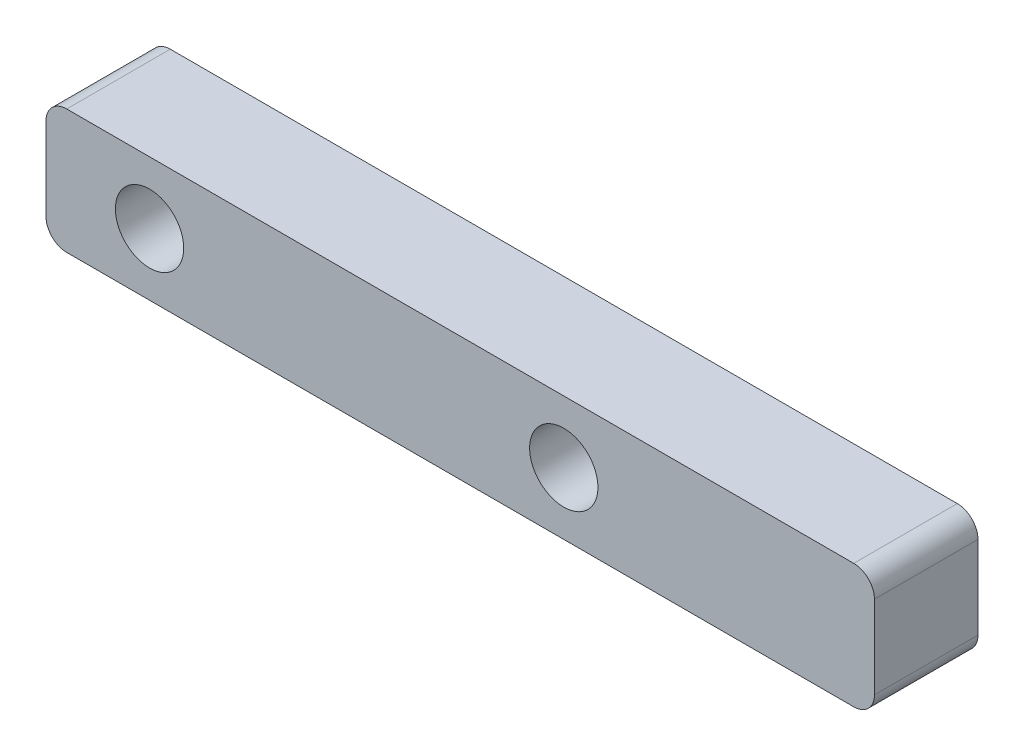
ISO-10303-21;
HEADER;
FILE_DESCRIPTION(('STEP AP214'),'2;1');
FILE_NAME('part.step','',(''),(''),'','','');
FILE_SCHEMA(('AUTOMOTIVE_DESIGN { 1 0 10303 214 1 1 1 1 }'));
ENDSEC;
DATA;
#1=APPLICATION_CONTEXT('core data for automotive mechanical design processes');
#2=APPLICATION_PROTOCOL_DEFINITION('international standard','automotive_design',2000,#1);
#3=PRODUCT_CONTEXT('',#1,'mechanical');
#4=PRODUCT('Part','Part','',(#3));
#5=PRODUCT_RELATED_PRODUCT_CATEGORY('part','',(#4));
#6=PRODUCT_DEFINITION_FORMATION('','',#4);
#7=PRODUCT_DEFINITION_CONTEXT('part definition',#1,'design');
#8=PRODUCT_DEFINITION('design','',#6,#7);
#9=PRODUCT_DEFINITION_SHAPE('','',#8);
#10=(LENGTH_UNIT() NAMED_UNIT(*) SI_UNIT(.MILLI.,.METRE.));
#11=(NAMED_UNIT(*) PLANE_ANGLE_UNIT() SI_UNIT($,.RADIAN.));
#12=(NAMED_UNIT(*) SI_UNIT($,.STERADIAN.) SOLID_ANGLE_UNIT());
#13=UNCERTAINTY_MEASURE_WITH_UNIT(LENGTH_MEASURE(1.E-05),#10,'distance_accuracy_value','');
#14=(GEOMETRIC_REPRESENTATION_CONTEXT(3) GLOBAL_UNCERTAINTY_ASSIGNED_CONTEXT((#13)) GLOBAL_UNIT_ASSIGNED_CONTEXT((#10,
#11,#12)) REPRESENTATION_CONTEXT('',''));
#15=CARTESIAN_POINT('',(0.,0.,0.));
#16=DIRECTION('',(0.,0.,1.));
#17=DIRECTION('',(1.,0.,0.));
#18=AXIS2_PLACEMENT_3D('',#15,#16,#17);
#19=CARTESIAN_POINT('',(20.,-3.,5.));
#20=DIRECTION('',(-1.,0.,0.));
#21=DIRECTION('',(0.,0.,1.));
#22=AXIS2_PLACEMENT_3D('',#19,#20,#21);
#23=PLANE('',#22);
#24=DIRECTION('',(0.,1.,0.));
#25=VECTOR('',#24,1.);
#26=CARTESIAN_POINT('',(20.,-3.,5.));
#27=LINE('',#26,#25);
#28=CARTESIAN_POINT('',(20.,-2.,5.));
#29=VERTEX_POINT('',#28);
#30=CARTESIAN_POINT('',(20.,2.,5.));
#31=VERTEX_POINT('',#30);
#32=EDGE_CURVE('E121',#29,#31,#27,.T.);
#33=ORIENTED_EDGE('',*,*,#32,.F.);
#34=DIRECTION('',(0.,0.,-1.));
#35=VECTOR('',#34,1.);
#36=CARTESIAN_POINT('',(20.,-2.,5.));
#37=LINE('',#36,#35);
#38=CARTESIAN_POINT('',(20.,-2.,0.));
#39=VERTEX_POINT('',#38);
#40=EDGE_CURVE('E106',#29,#39,#37,.T.);
#41=ORIENTED_EDGE('',*,*,#40,.T.);
#42=DIRECTION('',(0.,1.,0.));
#43=VECTOR('',#42,1.);
#44=CARTESIAN_POINT('',(20.,-3.,0.));
#45=LINE('',#44,#43);
#46=CARTESIAN_POINT('',(20.,2.,0.));
#47=VERTEX_POINT('',#46);
#48=EDGE_CURVE('E118',#39,#47,#45,.T.);
#49=ORIENTED_EDGE('',*,*,#48,.T.);
#50=DIRECTION('',(0.,0.,-1.));
#51=VECTOR('',#50,1.);
#52=CARTESIAN_POINT('',(20.,2.,5.));
#53=LINE('',#52,#51);
#54=EDGE_CURVE('E123',#47,#31,#53,.F.);
#55=ORIENTED_EDGE('',*,*,#54,.T.);
#56=EDGE_LOOP('',(#33,#41,#49,#55));
#57=FACE_BOUND('',#56,.T.);
#58=ADVANCED_FACE('F35',(#57),#23,.F.);
#59=CARTESIAN_POINT('',(-20.,3.,5.));
#60=DIRECTION('',(0.,-1.,0.));
#61=DIRECTION('',(0.,0.,-1.));
#62=AXIS2_PLACEMENT_3D('',#59,#60,#61);
#63=PLANE('',#62);
#64=DIRECTION('',(-1.,0.,0.));
#65=VECTOR('',#64,1.);
#66=CARTESIAN_POINT('',(-20.,3.,5.));
#67=LINE('',#66,#65);
#68=CARTESIAN_POINT('',(19.,3.,5.));
#69=VERTEX_POINT('',#68);
#70=CARTESIAN_POINT('',(-19.,3.,5.));
#71=VERTEX_POINT('',#70);
#72=EDGE_CURVE('E168',#69,#71,#67,.T.);
#73=ORIENTED_EDGE('',*,*,#72,.F.);
#74=DIRECTION('',(0.,0.,-1.));
#75=VECTOR('',#74,1.);
#76=CARTESIAN_POINT('',(19.,3.,5.));
#77=LINE('',#76,#75);
#78=CARTESIAN_POINT('',(19.,3.,0.));
#79=VERTEX_POINT('',#78);
#80=EDGE_CURVE('E11',#69,#79,#77,.T.);
#81=ORIENTED_EDGE('',*,*,#80,.T.);
#82=DIRECTION('',(-1.,0.,0.));
#83=VECTOR('',#82,1.);
#84=CARTESIAN_POINT('',(-20.,3.,0.));
#85=LINE('',#84,#83);
#86=CARTESIAN_POINT('',(-19.,3.,0.));
#87=VERTEX_POINT('',#86);
#88=EDGE_CURVE('E128',#79,#87,#85,.T.);
#89=ORIENTED_EDGE('',*,*,#88,.T.);
#90=DIRECTION('',(0.,0.,-1.));
#91=VECTOR('',#90,1.);
#92=CARTESIAN_POINT('',(-19.,3.,5.));
#93=LINE('',#92,#91);
#94=EDGE_CURVE('E43',#87,#71,#93,.F.);
#95=ORIENTED_EDGE('',*,*,#94,.T.);
#96=EDGE_LOOP('',(#73,#81,#89,#95));
#97=FACE_BOUND('',#96,.T.);
#98=ADVANCED_FACE('F167',(#97),#63,.F.);
#99=CARTESIAN_POINT('',(-20.,-3.,5.));
#100=DIRECTION('',(1.,0.,0.));
#101=DIRECTION('',(0.,0.,-1.));
#102=AXIS2_PLACEMENT_3D('',#99,#100,#101);
#103=PLANE('',#102);
#104=DIRECTION('',(0.,-1.,0.));
#105=VECTOR('',#104,1.);
#106=CARTESIAN_POINT('',(-20.,-3.,0.));
#107=LINE('',#106,#105);
#108=CARTESIAN_POINT('',(-20.,2.,0.));
#109=VERTEX_POINT('',#108);
#110=CARTESIAN_POINT('',(-20.,-2.,0.));
#111=VERTEX_POINT('',#110);
#112=EDGE_CURVE('E132',#109,#111,#107,.T.);
#113=ORIENTED_EDGE('',*,*,#112,.T.);
#114=DIRECTION('',(0.,0.,-1.));
#115=VECTOR('',#114,1.);
#116=CARTESIAN_POINT('',(-20.,-2.,5.));
#117=LINE('',#116,#115);
#118=CARTESIAN_POINT('',(-20.,-2.,5.));
#119=VERTEX_POINT('',#118);
#120=EDGE_CURVE('E50',#111,#119,#117,.F.);
#121=ORIENTED_EDGE('',*,*,#120,.T.);
#122=DIRECTION('',(0.,-1.,0.));
#123=VECTOR('',#122,1.);
#124=CARTESIAN_POINT('',(-20.,-3.,5.));
#125=LINE('',#124,#123);
#126=CARTESIAN_POINT('',(-20.,2.,5.));
#127=VERTEX_POINT('',#126);
#128=EDGE_CURVE('E174',#127,#119,#125,.T.);
#129=ORIENTED_EDGE('',*,*,#128,.F.);
#130=DIRECTION('',(0.,0.,-1.));
#131=VECTOR('',#130,1.);
#132=CARTESIAN_POINT('',(-20.,2.,5.));
#133=LINE('',#132,#131);
#134=EDGE_CURVE('E161',#127,#109,#133,.T.);
#135=ORIENTED_EDGE('',*,*,#134,.T.);
#136=EDGE_LOOP('',(#113,#121,#129,#135));
#137=FACE_BOUND('',#136,.T.);
#138=ADVANCED_FACE('F178',(#137),#103,.F.);
#139=CARTESIAN_POINT('',(-20.,-3.,5.));
#140=DIRECTION('',(0.,1.,0.));
#141=DIRECTION('',(0.,0.,1.));
#142=AXIS2_PLACEMENT_3D('',#139,#140,#141);
#143=PLANE('',#142);
#144=DIRECTION('',(1.,0.,0.));
#145=VECTOR('',#144,1.);
#146=CARTESIAN_POINT('',(-20.,-3.,0.));
#147=LINE('',#146,#145);
#148=CARTESIAN_POINT('',(-19.,-3.,0.));
#149=VERTEX_POINT('',#148);
#150=CARTESIAN_POINT('',(19.,-3.,0.));
#151=VERTEX_POINT('',#150);
#152=EDGE_CURVE('E142',#149,#151,#147,.T.);
#153=ORIENTED_EDGE('',*,*,#152,.T.);
#154=DIRECTION('',(0.,0.,-1.));
#155=VECTOR('',#154,1.);
#156=CARTESIAN_POINT('',(19.,-3.,5.));
#157=LINE('',#156,#155);
#158=CARTESIAN_POINT('',(19.,-3.,5.));
#159=VERTEX_POINT('',#158);
#160=EDGE_CURVE('E107',#151,#159,#157,.F.);
#161=ORIENTED_EDGE('',*,*,#160,.T.);
#162=DIRECTION('',(1.,0.,0.));
#163=VECTOR('',#162,1.);
#164=CARTESIAN_POINT('',(-20.,-3.,5.));
#165=LINE('',#164,#163);
#166=CARTESIAN_POINT('',(-19.,-3.,5.));
#167=VERTEX_POINT('',#166);
#168=EDGE_CURVE('E138',#167,#159,#165,.T.);
#169=ORIENTED_EDGE('',*,*,#168,.F.);
#170=DIRECTION('',(0.,0.,-1.));
#171=VECTOR('',#170,1.);
#172=CARTESIAN_POINT('',(-19.,-3.,5.));
#173=LINE('',#172,#171);
#174=EDGE_CURVE('E112',#167,#149,#173,.T.);
#175=ORIENTED_EDGE('',*,*,#174,.T.);
#176=EDGE_LOOP('',(#153,#161,#169,#175));
#177=FACE_BOUND('',#176,.T.);
#178=ADVANCED_FACE('F185',(#177),#143,.F.);
#179=CARTESIAN_POINT('',(0.,0.,5.));
#180=DIRECTION('',(0.,0.,-1.));
#181=DIRECTION('',(-1.,0.,0.));
#182=AXIS2_PLACEMENT_3D('',#179,#180,#181);
#183=PLANE('',#182);
#184=CARTESIAN_POINT('',(5.00000000000001,0.,5.));
#185=DIRECTION('',(0.,0.,1.));
#186=DIRECTION('',(1.,0.,0.));
#187=AXIS2_PLACEMENT_3D('',#184,#185,#186);
#188=CIRCLE('',#187,1.65);
#189=CARTESIAN_POINT('',(6.65000000000001,0.,5.));
#190=VERTEX_POINT('',#189);
#191=EDGE_CURVE('E145',#190,#190,#188,.T.);
#192=ORIENTED_EDGE('',*,*,#191,.F.);
#193=EDGE_LOOP('',(#192));
#194=FACE_BOUND('',#193,.T.);
#195=CARTESIAN_POINT('',(-15.,0.,5.));
#196=DIRECTION('',(0.,0.,1.));
#197=DIRECTION('',(1.,0.,0.));
#198=AXIS2_PLACEMENT_3D('',#195,#196,#197);
#199=CIRCLE('',#198,1.65);
#200=CARTESIAN_POINT('',(-13.35,0.,5.));
#201=VERTEX_POINT('',#200);
#202=EDGE_CURVE('E188',#201,#201,#199,.T.);
#203=ORIENTED_EDGE('',*,*,#202,.F.);
#204=EDGE_LOOP('',(#203));
#205=FACE_BOUND('',#204,.T.);
#206=ORIENTED_EDGE('',*,*,#168,.T.);
#207=CARTESIAN_POINT('',(19.,-2.,5.));
#208=DIRECTION('',(0.,0.,-1.));
#209=DIRECTION('',(-1.,0.,0.));
#210=AXIS2_PLACEMENT_3D('',#207,#208,#209);
#211=CIRCLE('',#210,1.);
#212=EDGE_CURVE('E159',#159,#29,#211,.F.);
#213=ORIENTED_EDGE('',*,*,#212,.T.);
#214=ORIENTED_EDGE('',*,*,#32,.T.);
#215=CARTESIAN_POINT('',(19.,2.,5.));
#216=DIRECTION('',(0.,0.,-1.));
#217=DIRECTION('',(-1.,0.,0.));
#218=AXIS2_PLACEMENT_3D('',#215,#216,#217);
#219=CIRCLE('',#218,1.);
#220=EDGE_CURVE('E155',#31,#69,#219,.F.);
#221=ORIENTED_EDGE('',*,*,#220,.T.);
#222=ORIENTED_EDGE('',*,*,#72,.T.);
#223=CARTESIAN_POINT('',(-19.,2.,5.));
#224=DIRECTION('',(0.,0.,-1.));
#225=DIRECTION('',(-1.,0.,0.));
#226=AXIS2_PLACEMENT_3D('',#223,#224,#225);
#227=CIRCLE('',#226,1.);
#228=EDGE_CURVE('E57',#71,#127,#227,.F.);
#229=ORIENTED_EDGE('',*,*,#228,.T.);
#230=ORIENTED_EDGE('',*,*,#128,.T.);
#231=CARTESIAN_POINT('',(-19.,-2.,5.));
#232=DIRECTION('',(0.,0.,-1.));
#233=DIRECTION('',(-1.,0.,0.));
#234=AXIS2_PLACEMENT_3D('',#231,#232,#233);
#235=CIRCLE('',#234,1.);
#236=EDGE_CURVE('E157',#119,#167,#235,.F.);
#237=ORIENTED_EDGE('',*,*,#236,.T.);
#238=EDGE_LOOP('',(#206,#213,#214,#221,#222,#229,#230,#237));
#239=FACE_BOUND('',#238,.T.);
#240=ADVANCED_FACE('F172',(#194,#205,#239),#183,.F.);
#241=CARTESIAN_POINT('',(0.,0.,0.));
#242=DIRECTION('',(0.,0.,-1.));
#243=DIRECTION('',(-1.,0.,0.));
#244=AXIS2_PLACEMENT_3D('',#241,#242,#243);
#245=PLANE('',#244);
#246=CARTESIAN_POINT('',(5.00000000000001,0.,0.));
#247=DIRECTION('',(0.,0.,-1.));
#248=DIRECTION('',(-1.,0.,0.));
#249=AXIS2_PLACEMENT_3D('',#246,#247,#248);
#250=CIRCLE('',#249,1.65);
#251=CARTESIAN_POINT('',(3.35000000000001,0.,0.));
#252=VERTEX_POINT('',#251);
#253=EDGE_CURVE('E129',#252,#252,#250,.T.);
#254=ORIENTED_EDGE('',*,*,#253,.F.);
#255=EDGE_LOOP('',(#254));
#256=FACE_BOUND('',#255,.T.);
#257=CARTESIAN_POINT('',(-15.,0.,0.));
#258=DIRECTION('',(0.,0.,-1.));
#259=DIRECTION('',(-1.,0.,0.));
#260=AXIS2_PLACEMENT_3D('',#257,#258,#259);
#261=CIRCLE('',#260,1.65);
#262=CARTESIAN_POINT('',(-16.65,0.,0.));
#263=VERTEX_POINT('',#262);
#264=EDGE_CURVE('E135',#263,#263,#261,.T.);
#265=ORIENTED_EDGE('',*,*,#264,.F.);
#266=EDGE_LOOP('',(#265));
#267=FACE_BOUND('',#266,.T.);
#268=ORIENTED_EDGE('',*,*,#48,.F.);
#269=CARTESIAN_POINT('',(19.,-2.,0.));
#270=DIRECTION('',(0.,0.,-1.));
#271=DIRECTION('',(-1.,0.,0.));
#272=AXIS2_PLACEMENT_3D('',#269,#270,#271);
#273=CIRCLE('',#272,1.);
#274=EDGE_CURVE('E102',#39,#151,#273,.T.);
#275=ORIENTED_EDGE('',*,*,#274,.T.);
#276=ORIENTED_EDGE('',*,*,#152,.F.);
#277=CARTESIAN_POINT('',(-19.,-2.,0.));
#278=DIRECTION('',(0.,0.,-1.));
#279=DIRECTION('',(-1.,0.,0.));
#280=AXIS2_PLACEMENT_3D('',#277,#278,#279);
#281=CIRCLE('',#280,1.);
#282=EDGE_CURVE('E113',#149,#111,#281,.T.);
#283=ORIENTED_EDGE('',*,*,#282,.T.);
#284=ORIENTED_EDGE('',*,*,#112,.F.);
#285=CARTESIAN_POINT('',(-19.,2.,0.));
#286=DIRECTION('',(0.,0.,-1.));
#287=DIRECTION('',(-1.,0.,0.));
#288=AXIS2_PLACEMENT_3D('',#285,#286,#287);
#289=CIRCLE('',#288,1.);
#290=EDGE_CURVE('E122',#109,#87,#289,.T.);
#291=ORIENTED_EDGE('',*,*,#290,.T.);
#292=ORIENTED_EDGE('',*,*,#88,.F.);
#293=CARTESIAN_POINT('',(19.,2.,0.));
#294=DIRECTION('',(0.,0.,-1.));
#295=DIRECTION('',(-1.,0.,0.));
#296=AXIS2_PLACEMENT_3D('',#293,#294,#295);
#297=CIRCLE('',#296,1.);
#298=EDGE_CURVE('E127',#79,#47,#297,.T.);
#299=ORIENTED_EDGE('',*,*,#298,.T.);
#300=EDGE_LOOP('',(#268,#275,#276,#283,#284,#291,#292,#299));
#301=FACE_BOUND('',#300,.T.);
#302=ADVANCED_FACE('F125',(#256,#267,#301),#245,.T.);
#303=CARTESIAN_POINT('',(-15.,0.,-2.));
#304=DIRECTION('',(0.,0.,1.));
#305=DIRECTION('',(1.,0.,0.));
#306=AXIS2_PLACEMENT_3D('',#303,#304,#305);
#307=CYLINDRICAL_SURFACE('',#306,1.65);
#308=ORIENTED_EDGE('',*,*,#264,.T.);
#309=EDGE_LOOP('',(#308));
#310=FACE_BOUND('',#309,.T.);
#311=ORIENTED_EDGE('',*,*,#202,.T.);
#312=EDGE_LOOP('',(#311));
#313=FACE_BOUND('',#312,.T.);
#314=ADVANCED_FACE('F201',(#310,#313),#307,.F.);
#315=CARTESIAN_POINT('',(5.00000000000001,0.,-2.));
#316=DIRECTION('',(0.,0.,1.));
#317=DIRECTION('',(1.,0.,0.));
#318=AXIS2_PLACEMENT_3D('',#315,#316,#317);
#319=CYLINDRICAL_SURFACE('',#318,1.65);
#320=ORIENTED_EDGE('',*,*,#253,.T.);
#321=EDGE_LOOP('',(#320));
#322=FACE_BOUND('',#321,.T.);
#323=ORIENTED_EDGE('',*,*,#191,.T.);
#324=EDGE_LOOP('',(#323));
#325=FACE_BOUND('',#324,.T.);
#326=ADVANCED_FACE('F194',(#322,#325),#319,.F.);
#327=CARTESIAN_POINT('',(19.,-2.,5.));
#328=DIRECTION('',(0.,0.,-1.));
#329=DIRECTION('',(-1.,0.,0.));
#330=AXIS2_PLACEMENT_3D('',#327,#328,#329);
#331=CYLINDRICAL_SURFACE('',#330,1.);
#332=ORIENTED_EDGE('',*,*,#212,.F.);
#333=ORIENTED_EDGE('',*,*,#160,.F.);
#334=ORIENTED_EDGE('',*,*,#274,.F.);
#335=ORIENTED_EDGE('',*,*,#40,.F.);
#336=EDGE_LOOP('',(#332,#333,#334,#335));
#337=FACE_BOUND('',#336,.T.);
#338=ADVANCED_FACE('F105',(#337),#331,.T.);
#339=CARTESIAN_POINT('',(-19.,-2.,5.));
#340=DIRECTION('',(0.,0.,-1.));
#341=DIRECTION('',(-1.,0.,0.));
#342=AXIS2_PLACEMENT_3D('',#339,#340,#341);
#343=CYLINDRICAL_SURFACE('',#342,1.);
#344=ORIENTED_EDGE('',*,*,#236,.F.);
#345=ORIENTED_EDGE('',*,*,#120,.F.);
#346=ORIENTED_EDGE('',*,*,#282,.F.);
#347=ORIENTED_EDGE('',*,*,#174,.F.);
#348=EDGE_LOOP('',(#344,#345,#346,#347));
#349=FACE_BOUND('',#348,.T.);
#350=ADVANCED_FACE('F182',(#349),#343,.T.);
#351=CARTESIAN_POINT('',(19.,2.,5.));
#352=DIRECTION('',(0.,0.,-1.));
#353=DIRECTION('',(-1.,0.,0.));
#354=AXIS2_PLACEMENT_3D('',#351,#352,#353);
#355=CYLINDRICAL_SURFACE('',#354,1.);
#356=ORIENTED_EDGE('',*,*,#220,.F.);
#357=ORIENTED_EDGE('',*,*,#54,.F.);
#358=ORIENTED_EDGE('',*,*,#298,.F.);
#359=ORIENTED_EDGE('',*,*,#80,.F.);
#360=EDGE_LOOP('',(#356,#357,#358,#359));
#361=FACE_BOUND('',#360,.T.);
#362=ADVANCED_FACE('F224',(#361),#355,.T.);
#363=CARTESIAN_POINT('',(-19.,2.,5.));
#364=DIRECTION('',(0.,0.,-1.));
#365=DIRECTION('',(-1.,0.,0.));
#366=AXIS2_PLACEMENT_3D('',#363,#364,#365);
#367=CYLINDRICAL_SURFACE('',#366,1.);
#368=ORIENTED_EDGE('',*,*,#228,.F.);
#369=ORIENTED_EDGE('',*,*,#94,.F.);
#370=ORIENTED_EDGE('',*,*,#290,.F.);
#371=ORIENTED_EDGE('',*,*,#134,.F.);
#372=EDGE_LOOP('',(#368,#369,#370,#371));
#373=FACE_BOUND('',#372,.T.);
#374=ADVANCED_FACE('F37',(#373),#367,.T.);
#375=CLOSED_SHELL('',(#58,#98,#138,#178,#240,#302,#314,#326,#338,#350,#362,#374));
#376=MANIFOLD_SOLID_BREP('B2',#375);
#377=ADVANCED_BREP_SHAPE_REPRESENTATION('',(#18,#376),#14);
#378=SHAPE_DEFINITION_REPRESENTATION(#9,#377);
ENDSEC;
END-ISO-10303-21;
